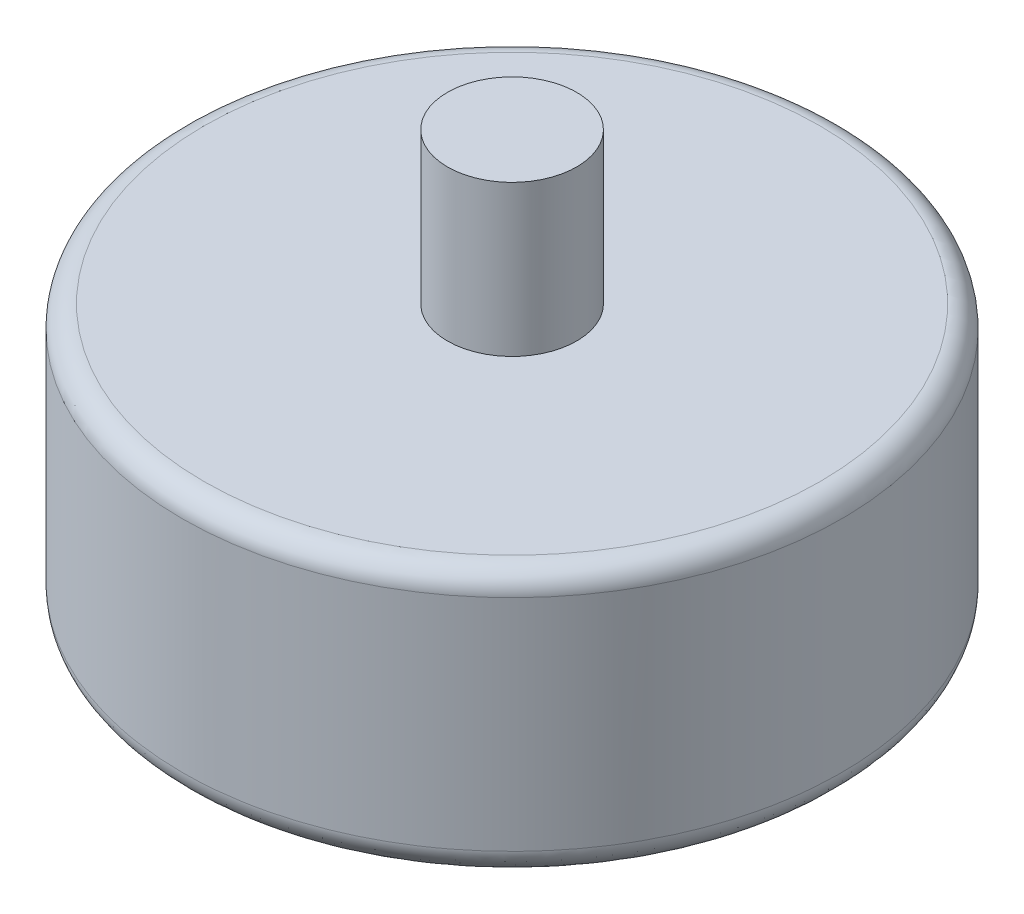
ISO-10303-21;
HEADER;
FILE_DESCRIPTION(('STEP AP214'),'2;1');
FILE_NAME('part.step','',(''),(''),'','','');
FILE_SCHEMA(('AUTOMOTIVE_DESIGN { 1 0 10303 214 1 1 1 1 }'));
ENDSEC;
DATA;
#1=APPLICATION_CONTEXT('core data for automotive mechanical design processes');
#2=APPLICATION_PROTOCOL_DEFINITION('international standard','automotive_design',2000,#1);
#3=PRODUCT_CONTEXT('',#1,'mechanical');
#4=PRODUCT('Part','Part','',(#3));
#5=PRODUCT_RELATED_PRODUCT_CATEGORY('part','',(#4));
#6=PRODUCT_DEFINITION_FORMATION('','',#4);
#7=PRODUCT_DEFINITION_CONTEXT('part definition',#1,'design');
#8=PRODUCT_DEFINITION('design','',#6,#7);
#9=PRODUCT_DEFINITION_SHAPE('','',#8);
#10=(LENGTH_UNIT() NAMED_UNIT(*) SI_UNIT(.MILLI.,.METRE.));
#11=(NAMED_UNIT(*) PLANE_ANGLE_UNIT() SI_UNIT($,.RADIAN.));
#12=(NAMED_UNIT(*) SI_UNIT($,.STERADIAN.) SOLID_ANGLE_UNIT());
#13=UNCERTAINTY_MEASURE_WITH_UNIT(LENGTH_MEASURE(1.E-05),#10,'distance_accuracy_value','');
#14=(GEOMETRIC_REPRESENTATION_CONTEXT(3) GLOBAL_UNCERTAINTY_ASSIGNED_CONTEXT((#13)) GLOBAL_UNIT_ASSIGNED_CONTEXT((#10,
#11,#12)) REPRESENTATION_CONTEXT('',''));
#15=CARTESIAN_POINT('',(0.,0.,0.));
#16=DIRECTION('',(0.,0.,1.));
#17=DIRECTION('',(1.,0.,0.));
#18=AXIS2_PLACEMENT_3D('',#15,#16,#17);
#19=CARTESIAN_POINT('',(0.,66.,0.));
#20=DIRECTION('',(0.,-1.,0.));
#21=DIRECTION('',(0.,0.,-1.));
#22=AXIS2_PLACEMENT_3D('',#19,#20,#21);
#23=CYLINDRICAL_SURFACE('',#22,76.5);
#24=CARTESIAN_POINT('',(0.,10.,76.5));
#25=CARTESIAN_POINT('',(-10.0138265829857,10.,76.5));
#26=CARTESIAN_POINT('',(-20.0237131539406,10.,74.5089097649374));
#27=CARTESIAN_POINT('',(-38.5268519979184,10.,66.8446587092894));
#28=CARTESIAN_POINT('',(-47.0128240784507,10.,61.1745134430911));
#29=CARTESIAN_POINT('',(-61.1745134430914,10.,47.0128240784504));
#30=CARTESIAN_POINT('',(-66.8446587092895,10.,38.5268519979182));
#31=CARTESIAN_POINT('',(-74.5089097649375,10.,20.0237131539403));
#32=CARTESIAN_POINT('',(-76.5,10.,10.0138265827948));
#33=CARTESIAN_POINT('',(-76.5,10.,-10.0138265827945));
#34=CARTESIAN_POINT('',(-74.5089097649374,10.,-20.0237131539406));
#35=CARTESIAN_POINT('',(-66.8446587092894,10.,-38.5268519979184));
#36=CARTESIAN_POINT('',(-61.1745134431022,10.,-47.0128240784396));
#37=CARTESIAN_POINT('',(-47.0128240784397,10.,-61.1745134431021));
#38=CARTESIAN_POINT('',(-38.5268519978878,10.,-66.8446587093021));
#39=CARTESIAN_POINT('',(-20.0237131539707,10.,-74.5089097649249));
#40=CARTESIAN_POINT('',(-10.0138265827946,10.,-76.5));
#41=CARTESIAN_POINT('',(10.0138265827947,10.,-76.5));
#42=CARTESIAN_POINT('',(20.0237131539528,10.,-74.5089097649324));
#43=CARTESIAN_POINT('',(38.5268519979062,10.,-66.8446587092944));
#44=CARTESIAN_POINT('',(47.0128240784268,10.,-61.174513443115));
#45=CARTESIAN_POINT('',(61.1745134431149,10.,-47.0128240784269));
#46=CARTESIAN_POINT('',(66.8446587092945,10.,-38.5268519979061));
#47=CARTESIAN_POINT('',(74.5089097649324,10.,-20.0237131539527));
#48=CARTESIAN_POINT('',(76.5,10.,-10.0138265827946));
#49=CARTESIAN_POINT('',(76.5,10.,10.0138265827947));
#50=CARTESIAN_POINT('',(74.5089097649324,10.,20.0237131539527));
#51=CARTESIAN_POINT('',(66.8446587092945,10.,38.526851997906));
#52=CARTESIAN_POINT('',(61.1745134430765,10.,47.0128240784653));
#53=CARTESIAN_POINT('',(47.0128240784653,10.,61.1745134430765));
#54=CARTESIAN_POINT('',(38.5268519979061,10.,66.8446587092945));
#55=CARTESIAN_POINT('',(20.0237131539527,10.,74.5089097649324));
#56=CARTESIAN_POINT('',(10.0138265829857,10.,76.5));
#57=CARTESIAN_POINT('',(0.,10.,76.5));
#58=(BOUNDED_CURVE() B_SPLINE_CURVE(3,(#24,#25,#26,#27,#28,#29,#30,#31,#32,#33,#34,#35,#36,#37,
#38,#39,#40,#41,#42,#43,#44,#45,#46,#47,#48,#49,#50,#51,#52,#53,#54,#55,#56,#57),.UNSPECIFIED.,
.T.,.F.) B_SPLINE_CURVE_WITH_KNOTS((4,2,2,2,2,2,2,2,2,2,2,2,2,2,2,2,4),(0.,0.392699081698725,
0.785398163397448,1.17809724509617,1.5707963267949,1.96349540849362,2.35619449019234,
2.74889357189107,3.14159265358979,3.53429173528852,3.92699081698724,4.31968989868597,
4.71238898038469,5.10508806208341,5.49778714378214,5.89048622548086,6.28318530717959),
.UNSPECIFIED.) CURVE() GEOMETRIC_REPRESENTATION_ITEM() RATIONAL_B_SPLINE_CURVE((1.,1.,1.,1.,1.,
1.,1.,1.,1.,1.,1.,1.,1.,1.,1.,1.,1.,1.,1.,1.,1.,1.,1.,1.,1.,1.,1.,1.,1.,1.,1.,1.,1.,1.)) REPRESENTATION_ITEM(''));
#59=CARTESIAN_POINT('',(0.,10.,76.5));
#60=VERTEX_POINT('',#59);
#61=EDGE_CURVE('E48',#60,#60,#58,.F.);
#62=ORIENTED_EDGE('',*,*,#61,.T.);
#63=EDGE_LOOP('',(#62));
#64=FACE_BOUND('',#63,.T.);
#65=CARTESIAN_POINT('',(0.,61.,0.));
#66=DIRECTION('',(0.,1.,0.));
#67=DIRECTION('',(0.,0.,1.));
#68=AXIS2_PLACEMENT_3D('',#65,#66,#67);
#69=CIRCLE('',#68,76.5);
#70=CARTESIAN_POINT('',(0.,61.,76.5));
#71=VERTEX_POINT('',#70);
#72=EDGE_CURVE('E53',#71,#71,#69,.F.);
#73=ORIENTED_EDGE('',*,*,#72,.T.);
#74=EDGE_LOOP('',(#73));
#75=FACE_BOUND('',#74,.T.);
#76=ADVANCED_FACE('F35',(#64,#75),#23,.T.);
#77=CARTESIAN_POINT('',(0.,66.,0.));
#78=DIRECTION('',(0.,1.,0.));
#79=DIRECTION('',(0.,0.,1.));
#80=AXIS2_PLACEMENT_3D('',#77,#78,#79);
#81=PLANE('',#80);
#82=CARTESIAN_POINT('',(0.,66.,0.));
#83=DIRECTION('',(0.,1.,0.));
#84=DIRECTION('',(0.,0.,1.));
#85=AXIS2_PLACEMENT_3D('',#82,#83,#84);
#86=CIRCLE('',#85,71.5);
#87=CARTESIAN_POINT('',(0.,66.,71.5));
#88=VERTEX_POINT('',#87);
#89=EDGE_CURVE('E58',#88,#88,#86,.T.);
#90=ORIENTED_EDGE('',*,*,#89,.T.);
#91=EDGE_LOOP('',(#90));
#92=FACE_BOUND('',#91,.T.);
#93=CARTESIAN_POINT('',(0.,66.,0.));
#94=DIRECTION('',(0.,1.,0.));
#95=DIRECTION('',(0.,0.,1.));
#96=AXIS2_PLACEMENT_3D('',#93,#94,#95);
#97=CIRCLE('',#96,15.);
#98=CARTESIAN_POINT('',(0.,66.,15.));
#99=VERTEX_POINT('',#98);
#100=EDGE_CURVE('E63',#99,#99,#97,.T.);
#101=ORIENTED_EDGE('',*,*,#100,.F.);
#102=EDGE_LOOP('',(#101));
#103=FACE_BOUND('',#102,.T.);
#104=ADVANCED_FACE('F79',(#92,#103),#81,.T.);
#105=CARTESIAN_POINT('',(0.,0.,0.));
#106=DIRECTION('',(0.,1.,0.));
#107=DIRECTION('',(0.,0.,1.));
#108=AXIS2_PLACEMENT_3D('',#105,#106,#107);
#109=PLANE('',#108);
#110=CARTESIAN_POINT('',(0.,0.,56.5));
#111=CARTESIAN_POINT('',(7.39583270508093,0.,56.5));
#112=CARTESIAN_POINT('',(14.7887554666557,0.,55.0294562316179));
#113=CARTESIAN_POINT('',(28.4544723905994,0.,49.3689309421576));
#114=CARTESIAN_POINT('',(34.7218896788564,0.,45.1811765951978));
#115=CARTESIAN_POINT('',(45.1811765952235,0.,34.7218896788821));
#116=CARTESIAN_POINT('',(49.3689309421576,0.,28.4544723905994));
#117=CARTESIAN_POINT('',(55.0294562316179,0.,14.7887554666557));
#118=CARTESIAN_POINT('',(56.5,0.,7.39583270493984));
#119=CARTESIAN_POINT('',(56.5,0.,-7.39583270493983));
#120=CARTESIAN_POINT('',(55.0294562316179,0.,-14.7887554666557));
#121=CARTESIAN_POINT('',(49.3689309421575,0.,-28.4544723905995));
#122=CARTESIAN_POINT('',(45.1811765952491,0.,-34.7218896788308));
#123=CARTESIAN_POINT('',(34.7218896788307,0.,-45.1811765952492));
#124=CARTESIAN_POINT('',(28.4544723905995,0.,-49.3689309421575));
#125=CARTESIAN_POINT('',(14.7887554666558,0.,-55.0294562316179));
#126=CARTESIAN_POINT('',(7.39583270493984,0.,-56.5));
#127=CARTESIAN_POINT('',(-7.39583270493983,0.,-56.5));
#128=CARTESIAN_POINT('',(-14.7887554666556,0.,-55.0294562316179));
#129=CARTESIAN_POINT('',(-28.4544723905994,0.,-49.3689309421576));
#130=CARTESIAN_POINT('',(-34.7218896788308,0.,-45.1811765952235));
#131=CARTESIAN_POINT('',(-45.1811765952492,0.,-34.7218896788564));
#132=CARTESIAN_POINT('',(-49.3689309421516,0.,-28.4544723906077));
#133=CARTESIAN_POINT('',(-55.0294562316238,0.,-14.7887554666476));
#134=CARTESIAN_POINT('',(-56.5,0.,-7.39583270493976));
#135=CARTESIAN_POINT('',(-56.5,0.,7.39583270493994));
#136=CARTESIAN_POINT('',(-55.0294562316239,0.,14.7887554666475));
#137=CARTESIAN_POINT('',(-49.3689309421516,0.,28.4544723906075));
#138=CARTESIAN_POINT('',(-45.1811765952207,0.,34.7218896788592));
#139=CARTESIAN_POINT('',(-34.7218896788594,0.,45.1811765952204));
#140=CARTESIAN_POINT('',(-28.4544723906077,0.,49.3689309421516));
#141=CARTESIAN_POINT('',(-14.7887554666476,0.,55.0294562316238));
#142=CARTESIAN_POINT('',(-7.39583270508094,0.,56.5));
#143=CARTESIAN_POINT('',(0.,0.,56.5));
#144=(BOUNDED_CURVE() B_SPLINE_CURVE(3,(#110,#111,#112,#113,#114,#115,#116,#117,#118,#119,#120,
#121,#122,#123,#124,#125,#126,#127,#128,#129,#130,#131,#132,#133,#134,#135,#136,#137,#138,#139,
#140,#141,#142,#143),.UNSPECIFIED.,.T.,.F.) B_SPLINE_CURVE_WITH_KNOTS((4,2,2,2,2,2,2,2,2,2,2,2,
2,2,2,2,4),(0.,0.392699081698724,0.785398163397448,1.17809724509617,1.5707963267949,
1.96349540849362,2.35619449019234,2.74889357189107,3.14159265358979,3.53429173528852,
3.92699081698724,4.31968989868597,4.71238898038469,5.10508806208341,5.49778714378214,
5.89048622548086,6.28318530717959),
.UNSPECIFIED.) CURVE() GEOMETRIC_REPRESENTATION_ITEM() RATIONAL_B_SPLINE_CURVE((1.,1.,1.,1.,1.,
1.,1.,1.,1.,1.,1.,1.,1.,1.,1.,1.,1.,1.,1.,1.,1.,1.,1.,1.,1.,1.,1.,1.,1.,1.,1.,1.,1.,1.)) REPRESENTATION_ITEM(''));
#145=CARTESIAN_POINT('',(0.,0.,56.5));
#146=VERTEX_POINT('',#145);
#147=EDGE_CURVE('E11',#146,#146,#144,.F.);
#148=ORIENTED_EDGE('',*,*,#147,.T.);
#149=EDGE_LOOP('',(#148));
#150=FACE_BOUND('',#149,.T.);
#151=ADVANCED_FACE('F80',(#150),#109,.F.);
#152=CARTESIAN_POINT('',(0.,101.,0.));
#153=DIRECTION('',(0.,-1.,0.));
#154=DIRECTION('',(0.,0.,-1.));
#155=AXIS2_PLACEMENT_3D('',#152,#153,#154);
#156=CYLINDRICAL_SURFACE('',#155,15.);
#157=CARTESIAN_POINT('',(0.,101.,0.));
#158=DIRECTION('',(0.,1.,0.));
#159=DIRECTION('',(0.,0.,1.));
#160=AXIS2_PLACEMENT_3D('',#157,#158,#159);
#161=CIRCLE('',#160,15.);
#162=CARTESIAN_POINT('',(0.,101.,15.));
#163=VERTEX_POINT('',#162);
#164=EDGE_CURVE('E103',#163,#163,#161,.T.);
#165=ORIENTED_EDGE('',*,*,#164,.F.);
#166=EDGE_LOOP('',(#165));
#167=FACE_BOUND('',#166,.T.);
#168=ORIENTED_EDGE('',*,*,#100,.T.);
#169=EDGE_LOOP('',(#168));
#170=FACE_BOUND('',#169,.T.);
#171=ADVANCED_FACE('F92',(#167,#170),#156,.T.);
#172=CARTESIAN_POINT('',(0.,101.,0.));
#173=DIRECTION('',(0.,1.,0.));
#174=DIRECTION('',(0.,0.,1.));
#175=AXIS2_PLACEMENT_3D('',#172,#173,#174);
#176=PLANE('',#175);
#177=ORIENTED_EDGE('',*,*,#164,.T.);
#178=EDGE_LOOP('',(#177));
#179=FACE_BOUND('',#178,.T.);
#180=ADVANCED_FACE('F85',(#179),#176,.T.);
#181=CARTESIAN_POINT('',(0.,61.,0.));
#182=DIRECTION('',(0.,1.,0.));
#183=DIRECTION('',(0.,0.,1.));
#184=AXIS2_PLACEMENT_3D('',#181,#182,#183);
#185=TOROIDAL_SURFACE('',#184,71.5,5.);
#186=ORIENTED_EDGE('',*,*,#72,.F.);
#187=EDGE_LOOP('',(#186));
#188=FACE_BOUND('',#187,.T.);
#189=ORIENTED_EDGE('',*,*,#89,.F.);
#190=EDGE_LOOP('',(#189));
#191=FACE_BOUND('',#190,.T.);
#192=ADVANCED_FACE('F83',(#188,#191),#185,.T.);
#193=CARTESIAN_POINT('',(0.,10.,76.5));
#194=CARTESIAN_POINT('',(10.0138265829857,10.,76.5));
#195=CARTESIAN_POINT('',(20.0237131539527,10.,74.5089097649324));
#196=CARTESIAN_POINT('',(38.5268519979061,10.,66.8446587092945));
#197=CARTESIAN_POINT('',(47.0128240784653,10.,61.1745134430765));
#198=CARTESIAN_POINT('',(61.1745134430765,10.,47.0128240784653));
#199=CARTESIAN_POINT('',(66.8446587092945,10.,38.526851997906));
#200=CARTESIAN_POINT('',(74.5089097649324,10.,20.0237131539527));
#201=CARTESIAN_POINT('',(76.5,10.,10.0138265827947));
#202=CARTESIAN_POINT('',(76.5,10.,-10.0138265827946));
#203=CARTESIAN_POINT('',(74.5089097649324,10.,-20.0237131539527));
#204=CARTESIAN_POINT('',(66.8446587092945,10.,-38.5268519979061));
#205=CARTESIAN_POINT('',(61.1745134431149,10.,-47.0128240784269));
#206=CARTESIAN_POINT('',(47.0128240784268,10.,-61.174513443115));
#207=CARTESIAN_POINT('',(38.5268519979062,10.,-66.8446587092944));
#208=CARTESIAN_POINT('',(20.0237131539528,10.,-74.5089097649324));
#209=CARTESIAN_POINT('',(10.0138265827947,10.,-76.5));
#210=CARTESIAN_POINT('',(-10.0138265827946,10.,-76.5));
#211=CARTESIAN_POINT('',(-20.0237131539707,10.,-74.5089097649249));
#212=CARTESIAN_POINT('',(-38.5268519978878,10.,-66.8446587093021));
#213=CARTESIAN_POINT('',(-47.0128240784397,10.,-61.1745134431021));
#214=CARTESIAN_POINT('',(-61.1745134431022,10.,-47.0128240784396));
#215=CARTESIAN_POINT('',(-66.8446587092894,10.,-38.5268519979184));
#216=CARTESIAN_POINT('',(-74.5089097649374,10.,-20.0237131539406));
#217=CARTESIAN_POINT('',(-76.5,10.,-10.0138265827945));
#218=CARTESIAN_POINT('',(-76.5,10.,10.0138265827948));
#219=CARTESIAN_POINT('',(-74.5089097649375,10.,20.0237131539403));
#220=CARTESIAN_POINT('',(-66.8446587092895,10.,38.5268519979182));
#221=CARTESIAN_POINT('',(-61.1745134430914,10.,47.0128240784504));
#222=CARTESIAN_POINT('',(-47.0128240784507,10.,61.1745134430911));
#223=CARTESIAN_POINT('',(-38.5268519979184,10.,66.8446587092894));
#224=CARTESIAN_POINT('',(-20.0237131539406,10.,74.5089097649374));
#225=CARTESIAN_POINT('',(-10.0138265829857,10.,76.5));
#226=CARTESIAN_POINT('',(0.,10.,76.5));
#227=CARTESIAN_POINT('',(0.,0.,76.5));
#228=CARTESIAN_POINT('',(10.0138265829857,1.9246321650965E-11,76.4999999999487));
#229=CARTESIAN_POINT('',(20.0237131539778,1.28418676826678E-11,74.5089097649621));
#230=CARTESIAN_POINT('',(38.5268519978809,-1.28175815540041E-11,66.8446587092648));
#231=CARTESIAN_POINT('',(47.0128240784525,0.,61.1745134430637));
#232=CARTESIAN_POINT('',(61.1745134430893,0.,47.0128240784782));
#233=CARTESIAN_POINT('',(66.8446587092648,-9.62194651905679E-11,38.5268519979066));
#234=CARTESIAN_POINT('',(74.5089097649621,9.62264040844718E-11,20.0237131539521));
#235=CARTESIAN_POINT('',(76.5,0.,10.0138265827947));
#236=CARTESIAN_POINT('',(76.5,0.,-10.0138265827946));
#237=CARTESIAN_POINT('',(74.5089097649621,0.,-20.023713153965));
#238=CARTESIAN_POINT('',(66.8446587092648,0.,-38.5268519978938));
#239=CARTESIAN_POINT('',(61.1745134431149,0.,-47.0128240784269));
#240=CARTESIAN_POINT('',(47.0128240784268,0.,-61.174513443115));
#241=CARTESIAN_POINT('',(38.5268519978939,6.41659703264397E-12,-66.8446587092647));
#242=CARTESIAN_POINT('',(20.0237131539651,-6.41312758569201E-12,-74.5089097649621));
#243=CARTESIAN_POINT('',(10.0138265827947,0.,-76.5));
#244=CARTESIAN_POINT('',(-10.0138265827946,0.,-76.5));
#245=CARTESIAN_POINT('',(-20.0237131539905,-8.98184806692077E-11,-74.5089097649621));
#246=CARTESIAN_POINT('',(-38.526851997868,8.9797663987496E-11,-66.8446587092648));
#247=CARTESIAN_POINT('',(-47.0128240784269,0.,-61.1745134430893));
#248=CARTESIAN_POINT('',(-61.174513443115,0.,-47.0128240784525));
#249=CARTESIAN_POINT('',(-66.8446587093096,3.84909085775182E-11,-38.5268519978798));
#250=CARTESIAN_POINT('',(-74.5089097649172,-3.84874391305663E-11,-20.0237131539791));
#251=CARTESIAN_POINT('',(-76.5,-6.41312758553107E-12,-10.0138265827945));
#252=CARTESIAN_POINT('',(-76.5,6.41659703248302E-12,10.0138265827948));
#253=CARTESIAN_POINT('',(-74.5089097649686,6.40098452119924E-12,20.0237131539532));
#254=CARTESIAN_POINT('',(-66.8446587092584,-6.42874009681485E-12,38.5268519979053));
#255=CARTESIAN_POINT('',(-61.1745134430914,0.,47.0128240784504));
#256=CARTESIAN_POINT('',(-47.0128240784507,0.,61.1745134430911));
#257=CARTESIAN_POINT('',(-38.5268519979055,5.77354955045392E-11,66.8446587093096));
#258=CARTESIAN_POINT('',(-20.0237131539535,-5.77320260575874E-11,74.5089097649172));
#259=CARTESIAN_POINT('',(-10.0138265829857,-1.92428522040131E-11,76.5000000000513));
#260=CARTESIAN_POINT('',(0.,0.,76.5));
#261=CARTESIAN_POINT('',(0.,0.,56.5));
#262=CARTESIAN_POINT('',(7.39583270508093,0.,56.5));
#263=CARTESIAN_POINT('',(14.7887554666557,0.,55.0294562316179));
#264=CARTESIAN_POINT('',(28.4544723905994,0.,49.3689309421576));
#265=CARTESIAN_POINT('',(34.7218896788564,0.,45.1811765951978));
#266=CARTESIAN_POINT('',(45.1811765952235,0.,34.7218896788821));
#267=CARTESIAN_POINT('',(49.3689309421576,0.,28.4544723905994));
#268=CARTESIAN_POINT('',(55.0294562316179,0.,14.7887554666557));
#269=CARTESIAN_POINT('',(56.5,0.,7.39583270493984));
#270=CARTESIAN_POINT('',(56.5,0.,-7.39583270493983));
#271=CARTESIAN_POINT('',(55.0294562316179,0.,-14.7887554666557));
#272=CARTESIAN_POINT('',(49.3689309421575,0.,-28.4544723905995));
#273=CARTESIAN_POINT('',(45.1811765952491,0.,-34.7218896788308));
#274=CARTESIAN_POINT('',(34.7218896788307,0.,-45.1811765952492));
#275=CARTESIAN_POINT('',(28.4544723905995,0.,-49.3689309421575));
#276=CARTESIAN_POINT('',(14.7887554666558,0.,-55.0294562316179));
#277=CARTESIAN_POINT('',(7.39583270493984,0.,-56.5));
#278=CARTESIAN_POINT('',(-7.39583270493983,0.,-56.5));
#279=CARTESIAN_POINT('',(-14.7887554666556,0.,-55.0294562316179));
#280=CARTESIAN_POINT('',(-28.4544723905994,0.,-49.3689309421576));
#281=CARTESIAN_POINT('',(-34.7218896788308,0.,-45.1811765952235));
#282=CARTESIAN_POINT('',(-45.1811765952492,0.,-34.7218896788564));
#283=CARTESIAN_POINT('',(-49.3689309421516,0.,-28.4544723906077));
#284=CARTESIAN_POINT('',(-55.0294562316238,0.,-14.7887554666476));
#285=CARTESIAN_POINT('',(-56.5,0.,-7.39583270493976));
#286=CARTESIAN_POINT('',(-56.5,0.,7.39583270493994));
#287=CARTESIAN_POINT('',(-55.0294562316239,0.,14.7887554666475));
#288=CARTESIAN_POINT('',(-49.3689309421516,0.,28.4544723906075));
#289=CARTESIAN_POINT('',(-45.1811765952207,0.,34.7218896788592));
#290=CARTESIAN_POINT('',(-34.7218896788594,0.,45.1811765952204));
#291=CARTESIAN_POINT('',(-28.4544723906077,0.,49.3689309421516));
#292=CARTESIAN_POINT('',(-14.7887554666476,0.,55.0294562316238));
#293=CARTESIAN_POINT('',(-7.39583270508094,0.,56.5));
#294=CARTESIAN_POINT('',(0.,0.,56.5));
#295=(BOUNDED_SURFACE() B_SPLINE_SURFACE(2,3,((#193,#194,#195,#196,#197,#198,#199,#200,#201,
#202,#203,#204,#205,#206,#207,#208,#209,#210,#211,#212,#213,#214,#215,#216,#217,#218,#219,#220,
#221,#222,#223,#224,#225,#226),(#227,#228,#229,#230,#231,#232,#233,#234,#235,#236,#237,#238,
#239,#240,#241,#242,#243,#244,#245,#246,#247,#248,#249,#250,#251,#252,#253,#254,#255,#256,#257,
#258,#259,#260),(#261,#262,#263,#264,#265,#266,#267,#268,#269,#270,#271,#272,#273,#274,#275,
#276,#277,#278,#279,#280,#281,#282,#283,#284,#285,#286,#287,#288,#289,#290,#291,#292,#293,
#294)),.UNSPECIFIED.,.F.,.T.,.F.) B_SPLINE_SURFACE_WITH_KNOTS((3,3),(4,2,2,2,2,2,2,2,2,2,2,2,2,
2,2,2,4),(0.,1.),(0.,0.392699081698724,0.785398163397448,1.17809724509617,1.5707963267949,
1.96349540849362,2.35619449019234,2.74889357189107,3.14159265358979,3.53429173528852,
3.92699081698724,4.31968989868597,4.71238898038469,5.10508806208341,5.49778714378214,
5.89048622548086,6.28318530717959),
.UNSPECIFIED.) GEOMETRIC_REPRESENTATION_ITEM() RATIONAL_B_SPLINE_SURFACE(((1.,1.,1.,1.,1.,1.,1.,
1.,1.,1.,1.,1.,1.,1.,1.,1.,1.,1.,1.,1.,1.,1.,1.,1.,1.,1.,1.,1.,1.,1.,1.,1.,1.,1.),
(0.707106781186548,0.707106781186548,0.707106781186548,0.707106781186548,0.707106781186548,
0.707106781186548,0.707106781186548,0.707106781186548,0.707106781186548,0.707106781186548,
0.707106781186548,0.707106781186548,0.707106781186548,0.707106781186548,0.707106781186548,
0.707106781186548,0.707106781186548,0.707106781186548,0.707106781186547,0.707106781186547,
0.707106781186548,0.707106781186548,0.707106781186548,0.707106781186548,0.707106781186548,
0.707106781186548,0.707106781186547,0.707106781186547,0.707106781186548,0.707106781186548,
0.707106781186548,0.707106781186548,0.707106781186548,0.707106781186548),(1.,1.,1.,1.,1.,1.,1.,
1.,1.,1.,1.,1.,1.,1.,1.,1.,1.,1.,1.,1.,1.,1.,1.,1.,1.,1.,1.,1.,1.,1.,1.,1.,1.,1.))) REPRESENTATION_ITEM('') SURFACE());
#296=ORIENTED_EDGE('',*,*,#147,.F.);
#297=EDGE_LOOP('',(#296));
#298=FACE_BOUND('',#297,.T.);
#299=ORIENTED_EDGE('',*,*,#61,.F.);
#300=EDGE_LOOP('',(#299));
#301=FACE_BOUND('',#300,.T.);
#302=ADVANCED_FACE('F38',(#298,#301),#295,.T.);
#303=CLOSED_SHELL('',(#76,#104,#151,#171,#180,#192,#302));
#304=MANIFOLD_SOLID_BREP('B2',#303);
#305=ADVANCED_BREP_SHAPE_REPRESENTATION('',(#18,#304),#14);
#306=SHAPE_DEFINITION_REPRESENTATION(#9,#305);
ENDSEC;
END-ISO-10303-21;
